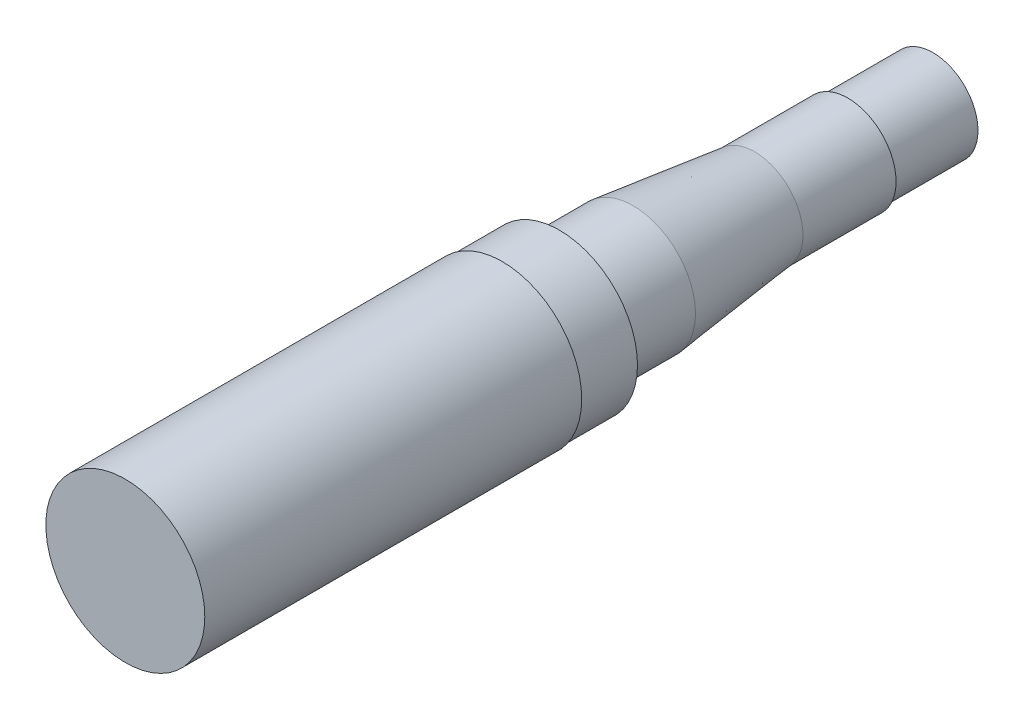
ISO-10303-21;
HEADER;
FILE_DESCRIPTION(('STEP AP214'),'2;1');
FILE_NAME('part.step','',(''),(''),'','','');
FILE_SCHEMA(('AUTOMOTIVE_DESIGN { 1 0 10303 214 1 1 1 1 }'));
ENDSEC;
DATA;
#1=APPLICATION_CONTEXT('core data for automotive mechanical design processes');
#2=APPLICATION_PROTOCOL_DEFINITION('international standard','automotive_design',2000,#1);
#3=PRODUCT_CONTEXT('',#1,'mechanical');
#4=PRODUCT('Part','Part','',(#3));
#5=PRODUCT_RELATED_PRODUCT_CATEGORY('part','',(#4));
#6=PRODUCT_DEFINITION_FORMATION('','',#4);
#7=PRODUCT_DEFINITION_CONTEXT('part definition',#1,'design');
#8=PRODUCT_DEFINITION('design','',#6,#7);
#9=PRODUCT_DEFINITION_SHAPE('','',#8);
#10=(LENGTH_UNIT() NAMED_UNIT(*) SI_UNIT(.MILLI.,.METRE.));
#11=(NAMED_UNIT(*) PLANE_ANGLE_UNIT() SI_UNIT($,.RADIAN.));
#12=(NAMED_UNIT(*) SI_UNIT($,.STERADIAN.) SOLID_ANGLE_UNIT());
#13=UNCERTAINTY_MEASURE_WITH_UNIT(LENGTH_MEASURE(1.E-05),#10,'distance_accuracy_value','');
#14=(GEOMETRIC_REPRESENTATION_CONTEXT(3) GLOBAL_UNCERTAINTY_ASSIGNED_CONTEXT((#13)) GLOBAL_UNIT_ASSIGNED_CONTEXT((#10,
#11,#12)) REPRESENTATION_CONTEXT('',''));
#15=CARTESIAN_POINT('',(0.,0.,0.));
#16=DIRECTION('',(0.,0.,1.));
#17=DIRECTION('',(1.,0.,0.));
#18=AXIS2_PLACEMENT_3D('',#15,#16,#17);
#19=CARTESIAN_POINT('',(0.,-12.5984,-225.8568));
#20=DIRECTION('',(0.,0.,1.));
#21=DIRECTION('',(1.,0.,0.));
#22=AXIS2_PLACEMENT_3D('',#19,#20,#21);
#23=PLANE('',#22);
#24=CARTESIAN_POINT('',(0.,0.,-225.8568));
#25=DIRECTION('',(0.,0.,1.));
#26=DIRECTION('',(1.,0.,0.));
#27=AXIS2_PLACEMENT_3D('',#24,#25,#26);
#28=CIRCLE('',#27,12.5984);
#29=CARTESIAN_POINT('',(12.5984,0.,-225.8568));
#30=VERTEX_POINT('',#29);
#31=EDGE_CURVE('E10',#30,#30,#28,.T.);
#32=ORIENTED_EDGE('',*,*,#31,.F.);
#33=EDGE_LOOP('',(#32));
#34=FACE_BOUND('',#33,.T.);
#35=ADVANCED_FACE('F34',(#34),#23,.F.);
#36=CARTESIAN_POINT('',(0.,0.,0.));
#37=DIRECTION('',(0.,0.,1.));
#38=DIRECTION('',(1.,0.,0.));
#39=AXIS2_PLACEMENT_3D('',#36,#37,#38);
#40=CYLINDRICAL_SURFACE('',#39,12.5984);
#41=CARTESIAN_POINT('',(0.,0.,-202.692));
#42=DIRECTION('',(0.,0.,1.));
#43=DIRECTION('',(1.,0.,0.));
#44=AXIS2_PLACEMENT_3D('',#41,#42,#43);
#45=CIRCLE('',#44,12.5984);
#46=CARTESIAN_POINT('',(12.5984,0.,-202.692));
#47=VERTEX_POINT('',#46);
#48=EDGE_CURVE('E40',#47,#47,#45,.T.);
#49=ORIENTED_EDGE('',*,*,#48,.F.);
#50=EDGE_LOOP('',(#49));
#51=FACE_BOUND('',#50,.T.);
#52=ORIENTED_EDGE('',*,*,#31,.T.);
#53=EDGE_LOOP('',(#52));
#54=FACE_BOUND('',#53,.T.);
#55=ADVANCED_FACE('F145',(#51,#54),#40,.T.);
#56=CARTESIAN_POINT('',(0.,0.,-202.692));
#57=DIRECTION('',(0.,0.,1.));
#58=DIRECTION('',(1.,0.,0.));
#59=AXIS2_PLACEMENT_3D('',#56,#57,#58);
#60=TOROIDAL_SURFACE('',#59,13.2334,0.634999999999998);
#61=CARTESIAN_POINT('',(0.,0.,-202.057));
#62=DIRECTION('',(0.,0.,1.));
#63=DIRECTION('',(1.,0.,0.));
#64=AXIS2_PLACEMENT_3D('',#61,#62,#63);
#65=CIRCLE('',#64,13.2334);
#66=CARTESIAN_POINT('',(13.2334,0.,-202.057));
#67=VERTEX_POINT('',#66);
#68=EDGE_CURVE('E45',#67,#67,#65,.T.);
#69=ORIENTED_EDGE('',*,*,#68,.F.);
#70=EDGE_LOOP('',(#69));
#71=FACE_BOUND('',#70,.T.);
#72=ORIENTED_EDGE('',*,*,#48,.T.);
#73=EDGE_LOOP('',(#72));
#74=FACE_BOUND('',#73,.T.);
#75=ADVANCED_FACE('F140',(#71,#74),#60,.F.);
#76=CARTESIAN_POINT('',(0.,-13.4874,-202.057));
#77=DIRECTION('',(0.,0.,1.));
#78=DIRECTION('',(1.,0.,0.));
#79=AXIS2_PLACEMENT_3D('',#76,#77,#78);
#80=PLANE('',#79);
#81=CARTESIAN_POINT('',(0.,0.,-202.057));
#82=DIRECTION('',(0.,0.,1.));
#83=DIRECTION('',(1.,0.,0.));
#84=AXIS2_PLACEMENT_3D('',#81,#82,#83);
#85=CIRCLE('',#84,13.4874);
#86=CARTESIAN_POINT('',(13.4874,0.,-202.057));
#87=VERTEX_POINT('',#86);
#88=EDGE_CURVE('E51',#87,#87,#85,.T.);
#89=ORIENTED_EDGE('',*,*,#88,.F.);
#90=EDGE_LOOP('',(#89));
#91=FACE_BOUND('',#90,.T.);
#92=ORIENTED_EDGE('',*,*,#68,.T.);
#93=EDGE_LOOP('',(#92));
#94=FACE_BOUND('',#93,.T.);
#95=ADVANCED_FACE('F134',(#91,#94),#80,.F.);
#96=CARTESIAN_POINT('',(0.,0.,0.));
#97=DIRECTION('',(0.,0.,1.));
#98=DIRECTION('',(1.,0.,0.));
#99=AXIS2_PLACEMENT_3D('',#96,#97,#98);
#100=CYLINDRICAL_SURFACE('',#99,13.4874);
#101=CARTESIAN_POINT('',(0.,0.,-176.022));
#102=DIRECTION('',(0.,0.,1.));
#103=DIRECTION('',(1.,0.,0.));
#104=AXIS2_PLACEMENT_3D('',#101,#102,#103);
#105=CIRCLE('',#104,13.4874);
#106=CARTESIAN_POINT('',(13.4874,0.,-176.022));
#107=VERTEX_POINT('',#106);
#108=EDGE_CURVE('E56',#107,#107,#105,.T.);
#109=ORIENTED_EDGE('',*,*,#108,.F.);
#110=EDGE_LOOP('',(#109));
#111=FACE_BOUND('',#110,.T.);
#112=ORIENTED_EDGE('',*,*,#88,.T.);
#113=EDGE_LOOP('',(#112));
#114=FACE_BOUND('',#113,.T.);
#115=ADVANCED_FACE('F128',(#111,#114),#100,.T.);
#116=CARTESIAN_POINT('',(0.,0.,-176.022));
#117=DIRECTION('',(0.,0.,1.));
#118=DIRECTION('',(1.,0.,0.));
#119=AXIS2_PLACEMENT_3D('',#116,#117,#118);
#120=CONICAL_SURFACE('',#119,13.4874,0.116264333041064);
#121=CARTESIAN_POINT('',(0.,0.,-141.986));
#122=DIRECTION('',(0.,0.,1.));
#123=DIRECTION('',(1.,0.,0.));
#124=AXIS2_PLACEMENT_3D('',#121,#122,#123);
#125=CIRCLE('',#124,17.4625);
#126=CARTESIAN_POINT('',(17.4625,0.,-141.986));
#127=VERTEX_POINT('',#126);
#128=EDGE_CURVE('E60',#127,#127,#125,.T.);
#129=ORIENTED_EDGE('',*,*,#128,.F.);
#130=EDGE_LOOP('',(#129));
#131=FACE_BOUND('',#130,.T.);
#132=ORIENTED_EDGE('',*,*,#108,.T.);
#133=EDGE_LOOP('',(#132));
#134=FACE_BOUND('',#133,.T.);
#135=ADVANCED_FACE('F122',(#131,#134),#120,.T.);
#136=CARTESIAN_POINT('',(0.,0.,0.));
#137=DIRECTION('',(0.,0.,1.));
#138=DIRECTION('',(1.,0.,0.));
#139=AXIS2_PLACEMENT_3D('',#136,#137,#138);
#140=CYLINDRICAL_SURFACE('',#139,17.4625);
#141=CARTESIAN_POINT('',(0.,0.,-123.317));
#142=DIRECTION('',(0.,0.,1.));
#143=DIRECTION('',(1.,0.,0.));
#144=AXIS2_PLACEMENT_3D('',#141,#142,#143);
#145=CIRCLE('',#144,17.4625);
#146=CARTESIAN_POINT('',(17.4625,0.,-123.317));
#147=VERTEX_POINT('',#146);
#148=EDGE_CURVE('E64',#147,#147,#145,.T.);
#149=ORIENTED_EDGE('',*,*,#148,.F.);
#150=EDGE_LOOP('',(#149));
#151=FACE_BOUND('',#150,.T.);
#152=ORIENTED_EDGE('',*,*,#128,.T.);
#153=EDGE_LOOP('',(#152));
#154=FACE_BOUND('',#153,.T.);
#155=ADVANCED_FACE('F116',(#151,#154),#140,.T.);
#156=CARTESIAN_POINT('',(0.,0.,-123.317));
#157=DIRECTION('',(0.,0.,1.));
#158=DIRECTION('',(1.,0.,0.));
#159=AXIS2_PLACEMENT_3D('',#156,#157,#158);
#160=TOROIDAL_SURFACE('',#159,19.3675,1.905);
#161=CARTESIAN_POINT('',(0.,0.,-121.412));
#162=DIRECTION('',(0.,0.,1.));
#163=DIRECTION('',(1.,0.,0.));
#164=AXIS2_PLACEMENT_3D('',#161,#162,#163);
#165=CIRCLE('',#164,19.3675);
#166=CARTESIAN_POINT('',(19.3675,0.,-121.412));
#167=VERTEX_POINT('',#166);
#168=EDGE_CURVE('E68',#167,#167,#165,.T.);
#169=ORIENTED_EDGE('',*,*,#168,.F.);
#170=EDGE_LOOP('',(#169));
#171=FACE_BOUND('',#170,.T.);
#172=ORIENTED_EDGE('',*,*,#148,.T.);
#173=EDGE_LOOP('',(#172));
#174=FACE_BOUND('',#173,.T.);
#175=ADVANCED_FACE('F110',(#171,#174),#160,.F.);
#176=CARTESIAN_POINT('',(1.52358469479366E-13,-21.8186,-121.412));
#177=DIRECTION('',(0.,0.,1.));
#178=DIRECTION('',(1.,0.,0.));
#179=AXIS2_PLACEMENT_3D('',#176,#177,#178);
#180=PLANE('',#179);
#181=CARTESIAN_POINT('',(0.,0.,-121.412));
#182=DIRECTION('',(0.,0.,1.));
#183=DIRECTION('',(1.,0.,0.));
#184=AXIS2_PLACEMENT_3D('',#181,#182,#183);
#185=CIRCLE('',#184,21.8186);
#186=CARTESIAN_POINT('',(21.8186,0.,-121.412));
#187=VERTEX_POINT('',#186);
#188=EDGE_CURVE('E72',#187,#187,#185,.T.);
#189=ORIENTED_EDGE('',*,*,#188,.F.);
#190=EDGE_LOOP('',(#189));
#191=FACE_BOUND('',#190,.T.);
#192=ORIENTED_EDGE('',*,*,#168,.T.);
#193=EDGE_LOOP('',(#192));
#194=FACE_BOUND('',#193,.T.);
#195=ADVANCED_FACE('F104',(#191,#194),#180,.F.);
#196=CARTESIAN_POINT('',(0.,0.,0.));
#197=DIRECTION('',(0.,0.,1.));
#198=DIRECTION('',(1.,0.,0.));
#199=AXIS2_PLACEMENT_3D('',#196,#197,#198);
#200=CYLINDRICAL_SURFACE('',#199,21.8186);
#201=CARTESIAN_POINT('',(0.,0.,-105.41));
#202=DIRECTION('',(0.,0.,1.));
#203=DIRECTION('',(1.,0.,0.));
#204=AXIS2_PLACEMENT_3D('',#201,#202,#203);
#205=CIRCLE('',#204,21.8186);
#206=CARTESIAN_POINT('',(21.8186,0.,-105.41));
#207=VERTEX_POINT('',#206);
#208=EDGE_CURVE('E76',#207,#207,#205,.T.);
#209=ORIENTED_EDGE('',*,*,#208,.F.);
#210=EDGE_LOOP('',(#209));
#211=FACE_BOUND('',#210,.T.);
#212=ORIENTED_EDGE('',*,*,#188,.T.);
#213=EDGE_LOOP('',(#212));
#214=FACE_BOUND('',#213,.T.);
#215=ADVANCED_FACE('F98',(#211,#214),#200,.T.);
#216=CARTESIAN_POINT('',(1.55196345511577E-13,-22.225,-105.41));
#217=DIRECTION('',(0.,0.,1.));
#218=DIRECTION('',(1.,0.,0.));
#219=AXIS2_PLACEMENT_3D('',#216,#217,#218);
#220=PLANE('',#219);
#221=CARTESIAN_POINT('',(0.,0.,-105.41));
#222=DIRECTION('',(0.,0.,1.));
#223=DIRECTION('',(1.,0.,0.));
#224=AXIS2_PLACEMENT_3D('',#221,#222,#223);
#225=CIRCLE('',#224,22.225);
#226=CARTESIAN_POINT('',(22.225,0.,-105.41));
#227=VERTEX_POINT('',#226);
#228=EDGE_CURVE('E79',#227,#227,#225,.T.);
#229=ORIENTED_EDGE('',*,*,#228,.F.);
#230=EDGE_LOOP('',(#229));
#231=FACE_BOUND('',#230,.T.);
#232=ORIENTED_EDGE('',*,*,#208,.T.);
#233=EDGE_LOOP('',(#232));
#234=FACE_BOUND('',#233,.T.);
#235=ADVANCED_FACE('F92',(#231,#234),#220,.F.);
#236=CARTESIAN_POINT('',(0.,0.,0.));
#237=DIRECTION('',(0.,0.,1.));
#238=DIRECTION('',(1.,0.,0.));
#239=AXIS2_PLACEMENT_3D('',#236,#237,#238);
#240=CYLINDRICAL_SURFACE('',#239,22.225);
#241=CARTESIAN_POINT('',(0.,0.,0.));
#242=DIRECTION('',(0.,0.,1.));
#243=DIRECTION('',(1.,0.,0.));
#244=AXIS2_PLACEMENT_3D('',#241,#242,#243);
#245=CIRCLE('',#244,22.225);
#246=CARTESIAN_POINT('',(22.225,0.,0.));
#247=VERTEX_POINT('',#246);
#248=EDGE_CURVE('E82',#247,#247,#245,.T.);
#249=ORIENTED_EDGE('',*,*,#248,.F.);
#250=EDGE_LOOP('',(#249));
#251=FACE_BOUND('',#250,.T.);
#252=ORIENTED_EDGE('',*,*,#228,.T.);
#253=EDGE_LOOP('',(#252));
#254=FACE_BOUND('',#253,.T.);
#255=ADVANCED_FACE('F89',(#251,#254),#240,.T.);
#256=CARTESIAN_POINT('',(0.,0.,0.));
#257=DIRECTION('',(0.,0.,-1.));
#258=DIRECTION('',(-1.,0.,0.));
#259=AXIS2_PLACEMENT_3D('',#256,#257,#258);
#260=PLANE('',#259);
#261=ORIENTED_EDGE('',*,*,#248,.T.);
#262=EDGE_LOOP('',(#261));
#263=FACE_BOUND('',#262,.T.);
#264=ADVANCED_FACE('F87',(#263),#260,.F.);
#265=CLOSED_SHELL('',(#35,#55,#75,#95,#115,#135,#155,#175,#195,#215,#235,#255,#264));
#266=MANIFOLD_SOLID_BREP('B2',#265);
#267=ADVANCED_BREP_SHAPE_REPRESENTATION('',(#18,#266),#14);
#268=SHAPE_DEFINITION_REPRESENTATION(#9,#267);
ENDSEC;
END-ISO-10303-21;
